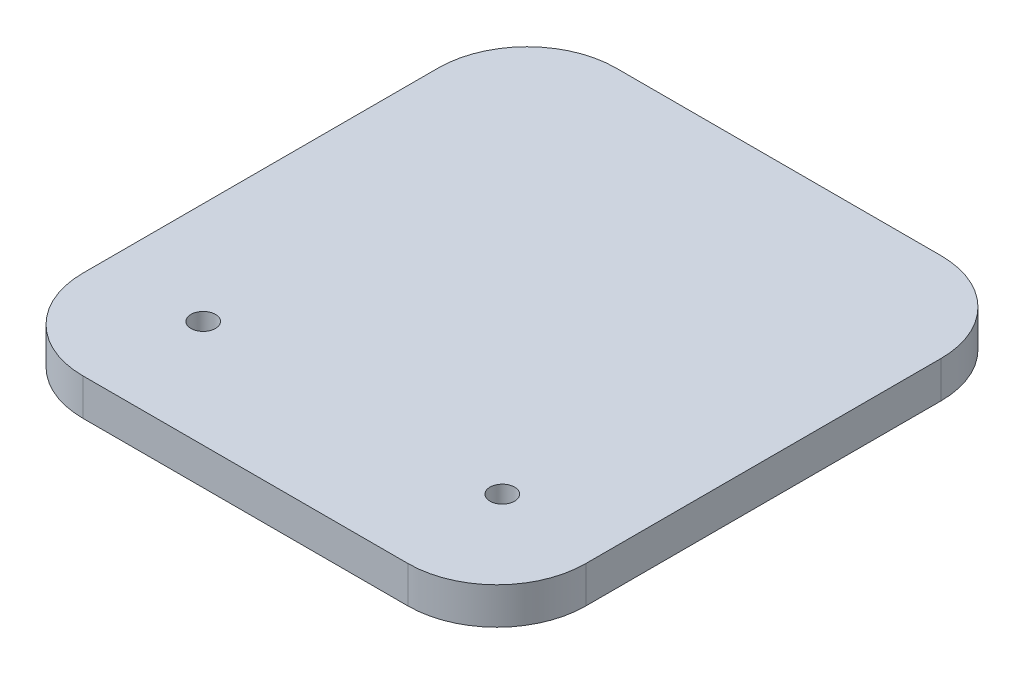
ISO-10303-21;
HEADER;
FILE_DESCRIPTION(('STEP AP214'),'2;1');
FILE_NAME('part.step','',(''),(''),'','','');
FILE_SCHEMA(('AUTOMOTIVE_DESIGN { 1 0 10303 214 1 1 1 1 }'));
ENDSEC;
DATA;
#1=APPLICATION_CONTEXT('core data for automotive mechanical design processes');
#2=APPLICATION_PROTOCOL_DEFINITION('international standard','automotive_design',2000,#1);
#3=PRODUCT_CONTEXT('',#1,'mechanical');
#4=PRODUCT('Part','Part','',(#3));
#5=PRODUCT_RELATED_PRODUCT_CATEGORY('part','',(#4));
#6=PRODUCT_DEFINITION_FORMATION('','',#4);
#7=PRODUCT_DEFINITION_CONTEXT('part definition',#1,'design');
#8=PRODUCT_DEFINITION('design','',#6,#7);
#9=PRODUCT_DEFINITION_SHAPE('','',#8);
#10=(LENGTH_UNIT() NAMED_UNIT(*) SI_UNIT(.MILLI.,.METRE.));
#11=(NAMED_UNIT(*) PLANE_ANGLE_UNIT() SI_UNIT($,.RADIAN.));
#12=(NAMED_UNIT(*) SI_UNIT($,.STERADIAN.) SOLID_ANGLE_UNIT());
#13=UNCERTAINTY_MEASURE_WITH_UNIT(LENGTH_MEASURE(1.E-05),#10,'distance_accuracy_value','');
#14=(GEOMETRIC_REPRESENTATION_CONTEXT(3) GLOBAL_UNCERTAINTY_ASSIGNED_CONTEXT((#13)) GLOBAL_UNIT_ASSIGNED_CONTEXT((#10,
#11,#12)) REPRESENTATION_CONTEXT('',''));
#15=CARTESIAN_POINT('',(0.,0.,0.));
#16=DIRECTION('',(0.,0.,1.));
#17=DIRECTION('',(1.,0.,0.));
#18=AXIS2_PLACEMENT_3D('',#15,#16,#17);
#19=CARTESIAN_POINT('',(-19.05,14.7828,-60.8711));
#20=DIRECTION('',(0.,-1.,0.));
#21=DIRECTION('',(0.,0.,-1.));
#22=AXIS2_PLACEMENT_3D('',#19,#20,#21);
#23=CYLINDRICAL_SURFACE('',#22,12.7);
#24=DIRECTION('',(0.,-1.,0.));
#25=VECTOR('',#24,1.);
#26=CARTESIAN_POINT('',(-31.75,14.7828,-60.8711));
#27=LINE('',#26,#25);
#28=CARTESIAN_POINT('',(-31.75,14.7828,-60.8711));
#29=VERTEX_POINT('',#28);
#30=CARTESIAN_POINT('',(-31.75,9.525,-60.8711));
#31=VERTEX_POINT('',#30);
#32=EDGE_CURVE('E159',#29,#31,#27,.T.);
#33=ORIENTED_EDGE('',*,*,#32,.F.);
#34=CARTESIAN_POINT('',(-19.05,14.7828,-60.8711));
#35=DIRECTION('',(0.,-1.,0.));
#36=DIRECTION('',(0.,0.,-1.));
#37=AXIS2_PLACEMENT_3D('',#34,#35,#36);
#38=CIRCLE('',#37,12.7);
#39=CARTESIAN_POINT('',(-19.05,14.7828,-73.5711));
#40=VERTEX_POINT('',#39);
#41=EDGE_CURVE('E40',#40,#29,#38,.F.);
#42=ORIENTED_EDGE('',*,*,#41,.F.);
#43=DIRECTION('',(0.,-1.,0.));
#44=VECTOR('',#43,1.);
#45=CARTESIAN_POINT('',(-19.05,14.7828,-73.5711));
#46=LINE('',#45,#44);
#47=CARTESIAN_POINT('',(-19.05,9.525,-73.5711));
#48=VERTEX_POINT('',#47);
#49=EDGE_CURVE('E162',#48,#40,#46,.F.);
#50=ORIENTED_EDGE('',*,*,#49,.F.);
#51=CARTESIAN_POINT('',(-19.05,9.525,-60.8711));
#52=DIRECTION('',(0.,-1.,0.));
#53=DIRECTION('',(0.,0.,-1.));
#54=AXIS2_PLACEMENT_3D('',#51,#52,#53);
#55=CIRCLE('',#54,12.7);
#56=EDGE_CURVE('E11',#31,#48,#55,.T.);
#57=ORIENTED_EDGE('',*,*,#56,.F.);
#58=EDGE_LOOP('',(#33,#42,#50,#57));
#59=FACE_BOUND('',#58,.T.);
#60=ADVANCED_FACE('F33',(#59),#23,.T.);
#61=CARTESIAN_POINT('',(27.432,14.7828,-60.8711));
#62=DIRECTION('',(0.,-1.,0.));
#63=DIRECTION('',(0.,0.,-1.));
#64=AXIS2_PLACEMENT_3D('',#61,#62,#63);
#65=CYLINDRICAL_SURFACE('',#64,12.7);
#66=DIRECTION('',(0.,-1.,0.));
#67=VECTOR('',#66,1.);
#68=CARTESIAN_POINT('',(27.432,14.7828,-73.5711));
#69=LINE('',#68,#67);
#70=CARTESIAN_POINT('',(27.432,14.7828,-73.5711));
#71=VERTEX_POINT('',#70);
#72=CARTESIAN_POINT('',(27.432,9.525,-73.5711));
#73=VERTEX_POINT('',#72);
#74=EDGE_CURVE('E151',#71,#73,#69,.T.);
#75=ORIENTED_EDGE('',*,*,#74,.F.);
#76=CARTESIAN_POINT('',(27.432,14.7828,-60.8711));
#77=DIRECTION('',(0.,-1.,0.));
#78=DIRECTION('',(0.,0.,-1.));
#79=AXIS2_PLACEMENT_3D('',#76,#77,#78);
#80=CIRCLE('',#79,12.7);
#81=CARTESIAN_POINT('',(40.132,14.7828,-60.8711));
#82=VERTEX_POINT('',#81);
#83=EDGE_CURVE('E156',#82,#71,#80,.F.);
#84=ORIENTED_EDGE('',*,*,#83,.F.);
#85=DIRECTION('',(0.,-1.,0.));
#86=VECTOR('',#85,1.);
#87=CARTESIAN_POINT('',(40.132,14.7828,-60.8711));
#88=LINE('',#87,#86);
#89=CARTESIAN_POINT('',(40.132,9.525,-60.8711));
#90=VERTEX_POINT('',#89);
#91=EDGE_CURVE('E154',#90,#82,#88,.F.);
#92=ORIENTED_EDGE('',*,*,#91,.F.);
#93=CARTESIAN_POINT('',(27.432,9.525,-60.8711));
#94=DIRECTION('',(0.,-1.,0.));
#95=DIRECTION('',(0.,0.,-1.));
#96=AXIS2_PLACEMENT_3D('',#93,#94,#95);
#97=CIRCLE('',#96,12.7);
#98=EDGE_CURVE('E119',#73,#90,#97,.T.);
#99=ORIENTED_EDGE('',*,*,#98,.F.);
#100=EDGE_LOOP('',(#75,#84,#92,#99));
#101=FACE_BOUND('',#100,.T.);
#102=ADVANCED_FACE('F198',(#101),#65,.T.);
#103=CARTESIAN_POINT('',(-19.05,14.7828,-10.0711));
#104=DIRECTION('',(0.,-1.,0.));
#105=DIRECTION('',(0.,0.,-1.));
#106=AXIS2_PLACEMENT_3D('',#103,#104,#105);
#107=CYLINDRICAL_SURFACE('',#106,12.7);
#108=DIRECTION('',(0.,-1.,0.));
#109=VECTOR('',#108,1.);
#110=CARTESIAN_POINT('',(-19.05,14.7828,2.6289));
#111=LINE('',#110,#109);
#112=CARTESIAN_POINT('',(-19.05,14.7828,2.6289));
#113=VERTEX_POINT('',#112);
#114=CARTESIAN_POINT('',(-19.05,9.525,2.6289));
#115=VERTEX_POINT('',#114);
#116=EDGE_CURVE('E106',#113,#115,#111,.T.);
#117=ORIENTED_EDGE('',*,*,#116,.F.);
#118=CARTESIAN_POINT('',(-19.05,14.7828,-10.0711));
#119=DIRECTION('',(0.,-1.,0.));
#120=DIRECTION('',(0.,0.,-1.));
#121=AXIS2_PLACEMENT_3D('',#118,#119,#120);
#122=CIRCLE('',#121,12.7);
#123=CARTESIAN_POINT('',(-31.75,14.7828,-10.0711));
#124=VERTEX_POINT('',#123);
#125=EDGE_CURVE('E146',#124,#113,#122,.F.);
#126=ORIENTED_EDGE('',*,*,#125,.F.);
#127=DIRECTION('',(0.,-1.,0.));
#128=VECTOR('',#127,1.);
#129=CARTESIAN_POINT('',(-31.75,14.7828,-10.0711));
#130=LINE('',#129,#128);
#131=CARTESIAN_POINT('',(-31.75,9.525,-10.0711));
#132=VERTEX_POINT('',#131);
#133=EDGE_CURVE('E143',#132,#124,#130,.F.);
#134=ORIENTED_EDGE('',*,*,#133,.F.);
#135=CARTESIAN_POINT('',(-19.05,9.525,-10.0711));
#136=DIRECTION('',(0.,-1.,0.));
#137=DIRECTION('',(0.,0.,-1.));
#138=AXIS2_PLACEMENT_3D('',#135,#136,#137);
#139=CIRCLE('',#138,12.7);
#140=EDGE_CURVE('E148',#115,#132,#139,.T.);
#141=ORIENTED_EDGE('',*,*,#140,.F.);
#142=EDGE_LOOP('',(#117,#126,#134,#141));
#143=FACE_BOUND('',#142,.T.);
#144=ADVANCED_FACE('F203',(#143),#107,.T.);
#145=CARTESIAN_POINT('',(27.432,14.7828,-10.0711));
#146=DIRECTION('',(0.,-1.,0.));
#147=DIRECTION('',(0.,0.,-1.));
#148=AXIS2_PLACEMENT_3D('',#145,#146,#147);
#149=CYLINDRICAL_SURFACE('',#148,12.7);
#150=DIRECTION('',(0.,-1.,0.));
#151=VECTOR('',#150,1.);
#152=CARTESIAN_POINT('',(40.132,14.7828,-10.0711));
#153=LINE('',#152,#151);
#154=CARTESIAN_POINT('',(40.132,14.7828,-10.0711));
#155=VERTEX_POINT('',#154);
#156=CARTESIAN_POINT('',(40.132,9.525,-10.0711));
#157=VERTEX_POINT('',#156);
#158=EDGE_CURVE('E100',#155,#157,#153,.T.);
#159=ORIENTED_EDGE('',*,*,#158,.F.);
#160=CARTESIAN_POINT('',(27.432,14.7828,-10.0711));
#161=DIRECTION('',(0.,-1.,0.));
#162=DIRECTION('',(0.,0.,-1.));
#163=AXIS2_PLACEMENT_3D('',#160,#161,#162);
#164=CIRCLE('',#163,12.7);
#165=CARTESIAN_POINT('',(27.432,14.7828,2.6289));
#166=VERTEX_POINT('',#165);
#167=EDGE_CURVE('E107',#166,#155,#164,.F.);
#168=ORIENTED_EDGE('',*,*,#167,.F.);
#169=DIRECTION('',(0.,-1.,0.));
#170=VECTOR('',#169,1.);
#171=CARTESIAN_POINT('',(27.432,14.7828,2.6289));
#172=LINE('',#171,#170);
#173=CARTESIAN_POINT('',(27.432,9.525,2.6289));
#174=VERTEX_POINT('',#173);
#175=EDGE_CURVE('E103',#174,#166,#172,.F.);
#176=ORIENTED_EDGE('',*,*,#175,.F.);
#177=CARTESIAN_POINT('',(27.432,9.525,-10.0711));
#178=DIRECTION('',(0.,-1.,0.));
#179=DIRECTION('',(0.,0.,-1.));
#180=AXIS2_PLACEMENT_3D('',#177,#178,#179);
#181=CIRCLE('',#180,12.7);
#182=EDGE_CURVE('E96',#157,#174,#181,.T.);
#183=ORIENTED_EDGE('',*,*,#182,.F.);
#184=EDGE_LOOP('',(#159,#168,#176,#183));
#185=FACE_BOUND('',#184,.T.);
#186=ADVANCED_FACE('F98',(#185),#149,.T.);
#187=CARTESIAN_POINT('',(-31.75,14.7828,2.6289));
#188=DIRECTION('',(1.,0.,0.));
#189=DIRECTION('',(0.,0.,-1.));
#190=AXIS2_PLACEMENT_3D('',#187,#188,#189);
#191=PLANE('',#190);
#192=DIRECTION('',(0.,0.,1.));
#193=VECTOR('',#192,1.);
#194=CARTESIAN_POINT('',(-31.75,14.7828,2.6289));
#195=LINE('',#194,#193);
#196=EDGE_CURVE('E125',#29,#124,#195,.T.);
#197=ORIENTED_EDGE('',*,*,#196,.F.);
#198=ORIENTED_EDGE('',*,*,#32,.T.);
#199=DIRECTION('',(0.,0.,1.));
#200=VECTOR('',#199,1.);
#201=CARTESIAN_POINT('',(-31.75,9.525,2.6289));
#202=LINE('',#201,#200);
#203=EDGE_CURVE('E127',#31,#132,#202,.T.);
#204=ORIENTED_EDGE('',*,*,#203,.T.);
#205=ORIENTED_EDGE('',*,*,#133,.T.);
#206=EDGE_LOOP('',(#197,#198,#204,#205));
#207=FACE_BOUND('',#206,.T.);
#208=ADVANCED_FACE('F170',(#207),#191,.F.);
#209=CARTESIAN_POINT('',(-31.75,14.7828,2.6289));
#210=DIRECTION('',(0.,0.,-1.));
#211=DIRECTION('',(-1.,0.,0.));
#212=AXIS2_PLACEMENT_3D('',#209,#210,#211);
#213=PLANE('',#212);
#214=DIRECTION('',(1.,0.,0.));
#215=VECTOR('',#214,1.);
#216=CARTESIAN_POINT('',(-31.75,14.7828,2.6289));
#217=LINE('',#216,#215);
#218=EDGE_CURVE('E172',#113,#166,#217,.T.);
#219=ORIENTED_EDGE('',*,*,#218,.F.);
#220=ORIENTED_EDGE('',*,*,#116,.T.);
#221=DIRECTION('',(1.,0.,0.));
#222=VECTOR('',#221,1.);
#223=CARTESIAN_POINT('',(-31.75,9.525,2.6289));
#224=LINE('',#223,#222);
#225=EDGE_CURVE('E122',#115,#174,#224,.T.);
#226=ORIENTED_EDGE('',*,*,#225,.T.);
#227=ORIENTED_EDGE('',*,*,#175,.T.);
#228=EDGE_LOOP('',(#219,#220,#226,#227));
#229=FACE_BOUND('',#228,.T.);
#230=ADVANCED_FACE('F216',(#229),#213,.F.);
#231=CARTESIAN_POINT('',(40.132,14.7828,2.6289));
#232=DIRECTION('',(-1.,0.,0.));
#233=DIRECTION('',(0.,0.,1.));
#234=AXIS2_PLACEMENT_3D('',#231,#232,#233);
#235=PLANE('',#234);
#236=DIRECTION('',(0.,0.,-1.));
#237=VECTOR('',#236,1.);
#238=CARTESIAN_POINT('',(40.132,9.525,2.6289));
#239=LINE('',#238,#237);
#240=EDGE_CURVE('E113',#157,#90,#239,.T.);
#241=ORIENTED_EDGE('',*,*,#240,.T.);
#242=ORIENTED_EDGE('',*,*,#91,.T.);
#243=DIRECTION('',(0.,0.,-1.));
#244=VECTOR('',#243,1.);
#245=CARTESIAN_POINT('',(40.132,14.7828,2.6289));
#246=LINE('',#245,#244);
#247=EDGE_CURVE('E115',#155,#82,#246,.T.);
#248=ORIENTED_EDGE('',*,*,#247,.F.);
#249=ORIENTED_EDGE('',*,*,#158,.T.);
#250=EDGE_LOOP('',(#241,#242,#248,#249));
#251=FACE_BOUND('',#250,.T.);
#252=ADVANCED_FACE('F111',(#251),#235,.F.);
#253=CARTESIAN_POINT('',(-31.75,14.7828,-73.5711));
#254=DIRECTION('',(0.,0.,1.));
#255=DIRECTION('',(1.,0.,0.));
#256=AXIS2_PLACEMENT_3D('',#253,#254,#255);
#257=PLANE('',#256);
#258=DIRECTION('',(-1.,0.,0.));
#259=VECTOR('',#258,1.);
#260=CARTESIAN_POINT('',(-31.75,9.525,-73.5711));
#261=LINE('',#260,#259);
#262=EDGE_CURVE('E121',#73,#48,#261,.T.);
#263=ORIENTED_EDGE('',*,*,#262,.T.);
#264=ORIENTED_EDGE('',*,*,#49,.T.);
#265=DIRECTION('',(-1.,0.,0.));
#266=VECTOR('',#265,1.);
#267=CARTESIAN_POINT('',(-31.75,14.7828,-73.5711));
#268=LINE('',#267,#266);
#269=EDGE_CURVE('E116',#71,#40,#268,.T.);
#270=ORIENTED_EDGE('',*,*,#269,.F.);
#271=ORIENTED_EDGE('',*,*,#74,.T.);
#272=EDGE_LOOP('',(#263,#264,#270,#271));
#273=FACE_BOUND('',#272,.T.);
#274=ADVANCED_FACE('F222',(#273),#257,.F.);
#275=CARTESIAN_POINT('',(-31.75,14.7828,-73.5711));
#276=DIRECTION('',(0.,-1.,0.));
#277=DIRECTION('',(0.,0.,-1.));
#278=AXIS2_PLACEMENT_3D('',#275,#276,#277);
#279=PLANE('',#278);
#280=CARTESIAN_POINT('',(-17.1774006466846,14.7828,-12.7));
#281=DIRECTION('',(0.,-1.,0.));
#282=DIRECTION('',(0.,0.,-1.));
#283=AXIS2_PLACEMENT_3D('',#280,#281,#282);
#284=CIRCLE('',#283,1.7526);
#285=CARTESIAN_POINT('',(-17.1774006466846,14.7828,-14.4526));
#286=VERTEX_POINT('',#285);
#287=EDGE_CURVE('E135',#286,#286,#284,.T.);
#288=ORIENTED_EDGE('',*,*,#287,.T.);
#289=EDGE_LOOP('',(#288));
#290=FACE_BOUND('',#289,.T.);
#291=CARTESIAN_POINT('',(25.5760488168302,14.7828,-12.7));
#292=DIRECTION('',(0.,-1.,0.));
#293=DIRECTION('',(0.,0.,-1.));
#294=AXIS2_PLACEMENT_3D('',#291,#292,#293);
#295=CIRCLE('',#294,1.7526);
#296=CARTESIAN_POINT('',(25.5760488168302,14.7828,-14.4526));
#297=VERTEX_POINT('',#296);
#298=EDGE_CURVE('E134',#297,#297,#295,.T.);
#299=ORIENTED_EDGE('',*,*,#298,.T.);
#300=EDGE_LOOP('',(#299));
#301=FACE_BOUND('',#300,.T.);
#302=ORIENTED_EDGE('',*,*,#269,.T.);
#303=ORIENTED_EDGE('',*,*,#41,.T.);
#304=ORIENTED_EDGE('',*,*,#196,.T.);
#305=ORIENTED_EDGE('',*,*,#125,.T.);
#306=ORIENTED_EDGE('',*,*,#218,.T.);
#307=ORIENTED_EDGE('',*,*,#167,.T.);
#308=ORIENTED_EDGE('',*,*,#247,.T.);
#309=ORIENTED_EDGE('',*,*,#83,.T.);
#310=EDGE_LOOP('',(#302,#303,#304,#305,#306,#307,#308,#309));
#311=FACE_BOUND('',#310,.T.);
#312=ADVANCED_FACE('F165',(#290,#301,#311),#279,.F.);
#313=CARTESIAN_POINT('',(-31.75,9.525,-73.5711));
#314=DIRECTION('',(0.,-1.,0.));
#315=DIRECTION('',(0.,0.,-1.));
#316=AXIS2_PLACEMENT_3D('',#313,#314,#315);
#317=PLANE('',#316);
#318=CARTESIAN_POINT('',(-17.1774006466846,9.52500000000001,-12.7));
#319=DIRECTION('',(0.,-1.,0.));
#320=DIRECTION('',(0.,0.,-1.));
#321=AXIS2_PLACEMENT_3D('',#318,#319,#320);
#322=CIRCLE('',#321,1.7526);
#323=CARTESIAN_POINT('',(-17.1774006466846,9.52500000000001,-14.4526));
#324=VERTEX_POINT('',#323);
#325=EDGE_CURVE('E136',#324,#324,#322,.T.);
#326=ORIENTED_EDGE('',*,*,#325,.F.);
#327=EDGE_LOOP('',(#326));
#328=FACE_BOUND('',#327,.T.);
#329=CARTESIAN_POINT('',(25.5760488168302,9.52500000000001,-12.7));
#330=DIRECTION('',(0.,-1.,0.));
#331=DIRECTION('',(0.,0.,-1.));
#332=AXIS2_PLACEMENT_3D('',#329,#330,#331);
#333=CIRCLE('',#332,1.7526);
#334=CARTESIAN_POINT('',(25.5760488168302,9.52500000000001,-14.4526));
#335=VERTEX_POINT('',#334);
#336=EDGE_CURVE('E131',#335,#335,#333,.T.);
#337=ORIENTED_EDGE('',*,*,#336,.F.);
#338=EDGE_LOOP('',(#337));
#339=FACE_BOUND('',#338,.T.);
#340=ORIENTED_EDGE('',*,*,#203,.F.);
#341=ORIENTED_EDGE('',*,*,#56,.T.);
#342=ORIENTED_EDGE('',*,*,#262,.F.);
#343=ORIENTED_EDGE('',*,*,#98,.T.);
#344=ORIENTED_EDGE('',*,*,#240,.F.);
#345=ORIENTED_EDGE('',*,*,#182,.T.);
#346=ORIENTED_EDGE('',*,*,#225,.F.);
#347=ORIENTED_EDGE('',*,*,#140,.T.);
#348=EDGE_LOOP('',(#340,#341,#342,#343,#344,#345,#346,#347));
#349=FACE_BOUND('',#348,.T.);
#350=ADVANCED_FACE('F118',(#328,#339,#349),#317,.T.);
#351=CARTESIAN_POINT('',(25.5760488168302,67.0832280351503,-12.7));
#352=DIRECTION('',(0.,1.,0.));
#353=DIRECTION('',(-0.999651766938592,0.,0.0263883469840449));
#354=AXIS2_PLACEMENT_3D('',#351,#352,#353);
#355=CYLINDRICAL_SURFACE('',#354,1.7526);
#356=ORIENTED_EDGE('',*,*,#336,.T.);
#357=EDGE_LOOP('',(#356));
#358=FACE_BOUND('',#357,.T.);
#359=ORIENTED_EDGE('',*,*,#298,.F.);
#360=EDGE_LOOP('',(#359));
#361=FACE_BOUND('',#360,.T.);
#362=ADVANCED_FACE('F183',(#358,#361),#355,.F.);
#363=CARTESIAN_POINT('',(-17.1774006466846,67.0832280351503,-12.7));
#364=DIRECTION('',(0.,1.,0.));
#365=DIRECTION('',(0.898023291875619,0.,0.439947914245399));
#366=AXIS2_PLACEMENT_3D('',#363,#364,#365);
#367=CYLINDRICAL_SURFACE('',#366,1.7526);
#368=ORIENTED_EDGE('',*,*,#325,.T.);
#369=EDGE_LOOP('',(#368));
#370=FACE_BOUND('',#369,.T.);
#371=ORIENTED_EDGE('',*,*,#287,.F.);
#372=EDGE_LOOP('',(#371));
#373=FACE_BOUND('',#372,.T.);
#374=ADVANCED_FACE('F185',(#370,#373),#367,.F.);
#375=CLOSED_SHELL('',(#60,#102,#144,#186,#208,#230,#252,#274,#312,#350,#362,#374));
#376=MANIFOLD_SOLID_BREP('B2',#375);
#377=ADVANCED_BREP_SHAPE_REPRESENTATION('',(#18,#376),#14);
#378=SHAPE_DEFINITION_REPRESENTATION(#9,#377);
ENDSEC;
END-ISO-10303-21;
